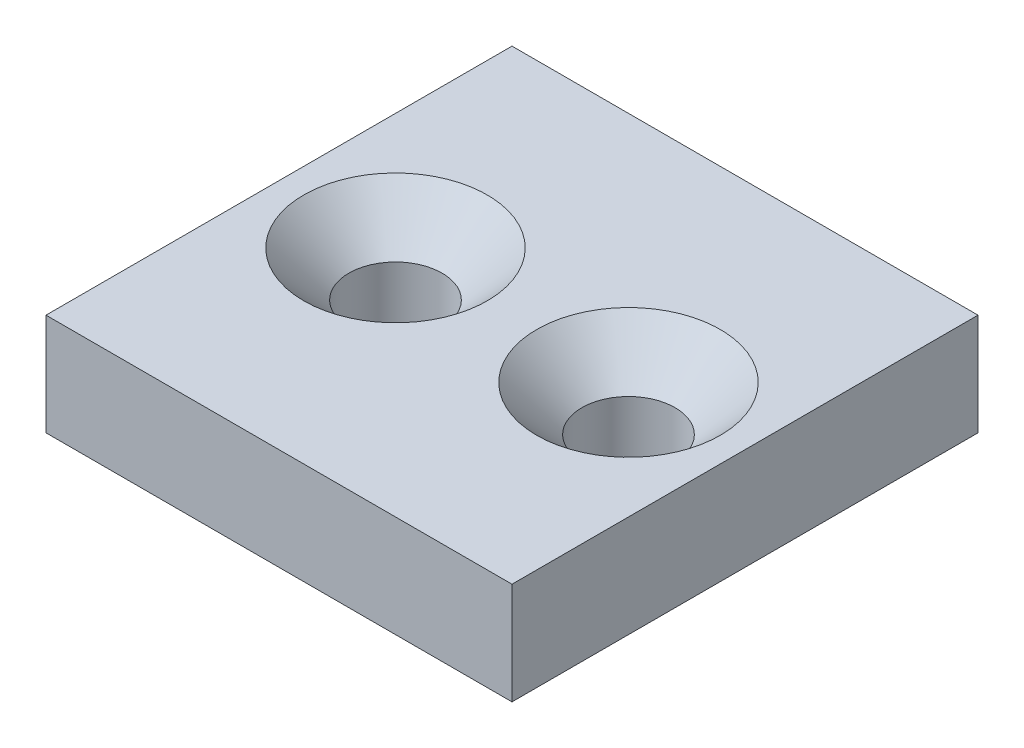
ISO-10303-21;
HEADER;
FILE_DESCRIPTION(('STEP AP214'),'2;1');
FILE_NAME('part.step','',(''),(''),'','','');
FILE_SCHEMA(('AUTOMOTIVE_DESIGN { 1 0 10303 214 1 1 1 1 }'));
ENDSEC;
DATA;
#1=APPLICATION_CONTEXT('core data for automotive mechanical design processes');
#2=APPLICATION_PROTOCOL_DEFINITION('international standard','automotive_design',2000,#1);
#3=PRODUCT_CONTEXT('',#1,'mechanical');
#4=PRODUCT('Part','Part','',(#3));
#5=PRODUCT_RELATED_PRODUCT_CATEGORY('part','',(#4));
#6=PRODUCT_DEFINITION_FORMATION('','',#4);
#7=PRODUCT_DEFINITION_CONTEXT('part definition',#1,'design');
#8=PRODUCT_DEFINITION('design','',#6,#7);
#9=PRODUCT_DEFINITION_SHAPE('','',#8);
#10=(LENGTH_UNIT() NAMED_UNIT(*) SI_UNIT(.MILLI.,.METRE.));
#11=(NAMED_UNIT(*) PLANE_ANGLE_UNIT() SI_UNIT($,.RADIAN.));
#12=(NAMED_UNIT(*) SI_UNIT($,.STERADIAN.) SOLID_ANGLE_UNIT());
#13=UNCERTAINTY_MEASURE_WITH_UNIT(LENGTH_MEASURE(1.E-05),#10,'distance_accuracy_value','');
#14=(GEOMETRIC_REPRESENTATION_CONTEXT(3) GLOBAL_UNCERTAINTY_ASSIGNED_CONTEXT((#13)) GLOBAL_UNIT_ASSIGNED_CONTEXT((#10,
#11,#12)) REPRESENTATION_CONTEXT('',''));
#15=CARTESIAN_POINT('',(0.,0.,0.));
#16=DIRECTION('',(0.,0.,1.));
#17=DIRECTION('',(1.,0.,0.));
#18=AXIS2_PLACEMENT_3D('',#15,#16,#17);
#19=CARTESIAN_POINT('',(16.,7.,-16.));
#20=DIRECTION('',(-1.,0.,0.));
#21=DIRECTION('',(0.,0.,1.));
#22=AXIS2_PLACEMENT_3D('',#19,#20,#21);
#23=PLANE('',#22);
#24=DIRECTION('',(0.,0.,-1.));
#25=VECTOR('',#24,1.);
#26=CARTESIAN_POINT('',(16.,0.,-16.));
#27=LINE('',#26,#25);
#28=CARTESIAN_POINT('',(16.,0.,16.));
#29=VERTEX_POINT('',#28);
#30=CARTESIAN_POINT('',(16.,0.,-16.));
#31=VERTEX_POINT('',#30);
#32=EDGE_CURVE('E96',#29,#31,#27,.T.);
#33=ORIENTED_EDGE('',*,*,#32,.T.);
#34=DIRECTION('',(0.,-1.,0.));
#35=VECTOR('',#34,1.);
#36=CARTESIAN_POINT('',(16.,7.,-16.));
#37=LINE('',#36,#35);
#38=CARTESIAN_POINT('',(16.,7.,-16.));
#39=VERTEX_POINT('',#38);
#40=EDGE_CURVE('E11',#39,#31,#37,.T.);
#41=ORIENTED_EDGE('',*,*,#40,.F.);
#42=DIRECTION('',(0.,0.,-1.));
#43=VECTOR('',#42,1.);
#44=CARTESIAN_POINT('',(16.,7.,-16.));
#45=LINE('',#44,#43);
#46=CARTESIAN_POINT('',(16.,7.,16.));
#47=VERTEX_POINT('',#46);
#48=EDGE_CURVE('E84',#47,#39,#45,.T.);
#49=ORIENTED_EDGE('',*,*,#48,.F.);
#50=DIRECTION('',(0.,-1.,0.));
#51=VECTOR('',#50,1.);
#52=CARTESIAN_POINT('',(16.,7.,16.));
#53=LINE('',#52,#51);
#54=EDGE_CURVE('E92',#47,#29,#53,.T.);
#55=ORIENTED_EDGE('',*,*,#54,.T.);
#56=EDGE_LOOP('',(#33,#41,#49,#55));
#57=FACE_BOUND('',#56,.T.);
#58=ADVANCED_FACE('F33',(#57),#23,.F.);
#59=CARTESIAN_POINT('',(-16.,7.,-16.));
#60=DIRECTION('',(0.,0.,1.));
#61=DIRECTION('',(1.,0.,0.));
#62=AXIS2_PLACEMENT_3D('',#59,#60,#61);
#63=PLANE('',#62);
#64=DIRECTION('',(-1.,0.,0.));
#65=VECTOR('',#64,1.);
#66=CARTESIAN_POINT('',(-16.,0.,-16.));
#67=LINE('',#66,#65);
#68=CARTESIAN_POINT('',(-16.,0.,-16.));
#69=VERTEX_POINT('',#68);
#70=EDGE_CURVE('E88',#31,#69,#67,.T.);
#71=ORIENTED_EDGE('',*,*,#70,.T.);
#72=DIRECTION('',(0.,-1.,0.));
#73=VECTOR('',#72,1.);
#74=CARTESIAN_POINT('',(-16.,7.,-16.));
#75=LINE('',#74,#73);
#76=CARTESIAN_POINT('',(-16.,7.,-16.));
#77=VERTEX_POINT('',#76);
#78=EDGE_CURVE('E41',#77,#69,#75,.T.);
#79=ORIENTED_EDGE('',*,*,#78,.F.);
#80=DIRECTION('',(-1.,0.,0.));
#81=VECTOR('',#80,1.);
#82=CARTESIAN_POINT('',(-16.,7.,-16.));
#83=LINE('',#82,#81);
#84=EDGE_CURVE('E79',#39,#77,#83,.T.);
#85=ORIENTED_EDGE('',*,*,#84,.F.);
#86=ORIENTED_EDGE('',*,*,#40,.T.);
#87=EDGE_LOOP('',(#71,#79,#85,#86));
#88=FACE_BOUND('',#87,.T.);
#89=ADVANCED_FACE('F87',(#88),#63,.F.);
#90=CARTESIAN_POINT('',(-16.,7.,-16.));
#91=DIRECTION('',(1.,0.,0.));
#92=DIRECTION('',(0.,0.,-1.));
#93=AXIS2_PLACEMENT_3D('',#90,#91,#92);
#94=PLANE('',#93);
#95=DIRECTION('',(0.,0.,1.));
#96=VECTOR('',#95,1.);
#97=CARTESIAN_POINT('',(-16.,0.,-16.));
#98=LINE('',#97,#96);
#99=CARTESIAN_POINT('',(-16.,0.,16.));
#100=VERTEX_POINT('',#99);
#101=EDGE_CURVE('E66',#69,#100,#98,.T.);
#102=ORIENTED_EDGE('',*,*,#101,.T.);
#103=DIRECTION('',(0.,-1.,0.));
#104=VECTOR('',#103,1.);
#105=CARTESIAN_POINT('',(-16.,7.,16.));
#106=LINE('',#105,#104);
#107=CARTESIAN_POINT('',(-16.,7.,16.));
#108=VERTEX_POINT('',#107);
#109=EDGE_CURVE('E89',#108,#100,#106,.T.);
#110=ORIENTED_EDGE('',*,*,#109,.F.);
#111=DIRECTION('',(0.,0.,1.));
#112=VECTOR('',#111,1.);
#113=CARTESIAN_POINT('',(-16.,7.,-16.));
#114=LINE('',#113,#112);
#115=EDGE_CURVE('E82',#77,#108,#114,.T.);
#116=ORIENTED_EDGE('',*,*,#115,.F.);
#117=ORIENTED_EDGE('',*,*,#78,.T.);
#118=EDGE_LOOP('',(#102,#110,#116,#117));
#119=FACE_BOUND('',#118,.T.);
#120=ADVANCED_FACE('F90',(#119),#94,.F.);
#121=CARTESIAN_POINT('',(-16.,7.,16.));
#122=DIRECTION('',(0.,0.,-1.));
#123=DIRECTION('',(-1.,0.,0.));
#124=AXIS2_PLACEMENT_3D('',#121,#122,#123);
#125=PLANE('',#124);
#126=DIRECTION('',(1.,0.,0.));
#127=VECTOR('',#126,1.);
#128=CARTESIAN_POINT('',(-16.,0.,16.));
#129=LINE('',#128,#127);
#130=EDGE_CURVE('E72',#100,#29,#129,.T.);
#131=ORIENTED_EDGE('',*,*,#130,.T.);
#132=ORIENTED_EDGE('',*,*,#54,.F.);
#133=DIRECTION('',(1.,0.,0.));
#134=VECTOR('',#133,1.);
#135=CARTESIAN_POINT('',(-16.,7.,16.));
#136=LINE('',#135,#134);
#137=EDGE_CURVE('E49',#108,#47,#136,.T.);
#138=ORIENTED_EDGE('',*,*,#137,.F.);
#139=ORIENTED_EDGE('',*,*,#109,.T.);
#140=EDGE_LOOP('',(#131,#132,#138,#139));
#141=FACE_BOUND('',#140,.T.);
#142=ADVANCED_FACE('F104',(#141),#125,.F.);
#143=CARTESIAN_POINT('',(0.,7.,0.));
#144=DIRECTION('',(0.,1.,0.));
#145=DIRECTION('',(0.,0.,1.));
#146=AXIS2_PLACEMENT_3D('',#143,#144,#145);
#147=PLANE('',#146);
#148=CARTESIAN_POINT('',(8.,7.,0.));
#149=DIRECTION('',(0.,1.,0.));
#150=DIRECTION('',(0.,0.,1.));
#151=AXIS2_PLACEMENT_3D('',#148,#149,#150);
#152=CIRCLE('',#151,6.3);
#153=CARTESIAN_POINT('',(8.,7.,6.3));
#154=VERTEX_POINT('',#153);
#155=EDGE_CURVE('E124',#154,#154,#152,.T.);
#156=ORIENTED_EDGE('',*,*,#155,.F.);
#157=EDGE_LOOP('',(#156));
#158=FACE_BOUND('',#157,.T.);
#159=CARTESIAN_POINT('',(-8.,7.,0.));
#160=DIRECTION('',(0.,1.,0.));
#161=DIRECTION('',(0.,0.,1.));
#162=AXIS2_PLACEMENT_3D('',#159,#160,#161);
#163=CIRCLE('',#162,6.3);
#164=CARTESIAN_POINT('',(-8.,7.,6.3));
#165=VERTEX_POINT('',#164);
#166=EDGE_CURVE('E115',#165,#165,#163,.T.);
#167=ORIENTED_EDGE('',*,*,#166,.F.);
#168=EDGE_LOOP('',(#167));
#169=FACE_BOUND('',#168,.T.);
#170=ORIENTED_EDGE('',*,*,#48,.T.);
#171=ORIENTED_EDGE('',*,*,#84,.T.);
#172=ORIENTED_EDGE('',*,*,#115,.T.);
#173=ORIENTED_EDGE('',*,*,#137,.T.);
#174=EDGE_LOOP('',(#170,#171,#172,#173));
#175=FACE_BOUND('',#174,.T.);
#176=ADVANCED_FACE('F80',(#158,#169,#175),#147,.T.);
#177=CARTESIAN_POINT('',(0.,0.,0.));
#178=DIRECTION('',(0.,1.,0.));
#179=DIRECTION('',(0.,0.,1.));
#180=AXIS2_PLACEMENT_3D('',#177,#178,#179);
#181=PLANE('',#180);
#182=CARTESIAN_POINT('',(8.,0.,0.));
#183=DIRECTION('',(0.,1.,0.));
#184=DIRECTION('',(0.,0.,1.));
#185=AXIS2_PLACEMENT_3D('',#182,#183,#184);
#186=CIRCLE('',#185,3.2);
#187=CARTESIAN_POINT('',(8.,0.,3.2));
#188=VERTEX_POINT('',#187);
#189=EDGE_CURVE('E118',#188,#188,#186,.T.);
#190=ORIENTED_EDGE('',*,*,#189,.T.);
#191=EDGE_LOOP('',(#190));
#192=FACE_BOUND('',#191,.T.);
#193=CARTESIAN_POINT('',(-8.,0.,0.));
#194=DIRECTION('',(0.,1.,0.));
#195=DIRECTION('',(0.,0.,1.));
#196=AXIS2_PLACEMENT_3D('',#193,#194,#195);
#197=CIRCLE('',#196,3.2);
#198=CARTESIAN_POINT('',(-8.,0.,3.2));
#199=VERTEX_POINT('',#198);
#200=EDGE_CURVE('E99',#199,#199,#197,.T.);
#201=ORIENTED_EDGE('',*,*,#200,.T.);
#202=EDGE_LOOP('',(#201));
#203=FACE_BOUND('',#202,.T.);
#204=ORIENTED_EDGE('',*,*,#32,.F.);
#205=ORIENTED_EDGE('',*,*,#130,.F.);
#206=ORIENTED_EDGE('',*,*,#101,.F.);
#207=ORIENTED_EDGE('',*,*,#70,.F.);
#208=EDGE_LOOP('',(#204,#205,#206,#207));
#209=FACE_BOUND('',#208,.T.);
#210=ADVANCED_FACE('F107',(#192,#203,#209),#181,.F.);
#211=CARTESIAN_POINT('',(-8.,7.,0.));
#212=DIRECTION('',(0.,1.,0.));
#213=DIRECTION('',(0.,0.,1.));
#214=AXIS2_PLACEMENT_3D('',#211,#212,#213);
#215=CYLINDRICAL_SURFACE('',#214,3.2);
#216=ORIENTED_EDGE('',*,*,#200,.F.);
#217=EDGE_LOOP('',(#216));
#218=FACE_BOUND('',#217,.T.);
#219=CARTESIAN_POINT('',(-8.,3.90000000000002,0.));
#220=DIRECTION('',(0.,1.,0.));
#221=DIRECTION('',(0.,0.,1.));
#222=AXIS2_PLACEMENT_3D('',#219,#220,#221);
#223=CIRCLE('',#222,3.2);
#224=CARTESIAN_POINT('',(-8.,3.90000000000002,3.2));
#225=VERTEX_POINT('',#224);
#226=EDGE_CURVE('E112',#225,#225,#223,.T.);
#227=ORIENTED_EDGE('',*,*,#226,.T.);
#228=EDGE_LOOP('',(#227));
#229=FACE_BOUND('',#228,.T.);
#230=ADVANCED_FACE('F138',(#218,#229),#215,.F.);
#231=CARTESIAN_POINT('',(-8.,7.,0.));
#232=DIRECTION('',(0.,1.,0.));
#233=DIRECTION('',(0.,0.,1.));
#234=AXIS2_PLACEMENT_3D('',#231,#232,#233);
#235=CONICAL_SURFACE('',#234,6.3,0.78539816339745);
#236=ORIENTED_EDGE('',*,*,#226,.F.);
#237=EDGE_LOOP('',(#236));
#238=FACE_BOUND('',#237,.T.);
#239=ORIENTED_EDGE('',*,*,#166,.T.);
#240=EDGE_LOOP('',(#239));
#241=FACE_BOUND('',#240,.T.);
#242=ADVANCED_FACE('F135',(#238,#241),#235,.F.);
#243=CARTESIAN_POINT('',(8.,7.,0.));
#244=DIRECTION('',(0.,1.,0.));
#245=DIRECTION('',(0.,0.,1.));
#246=AXIS2_PLACEMENT_3D('',#243,#244,#245);
#247=CYLINDRICAL_SURFACE('',#246,3.2);
#248=ORIENTED_EDGE('',*,*,#189,.F.);
#249=EDGE_LOOP('',(#248));
#250=FACE_BOUND('',#249,.T.);
#251=CARTESIAN_POINT('',(8.,3.90000000000002,0.));
#252=DIRECTION('',(0.,1.,0.));
#253=DIRECTION('',(0.,0.,1.));
#254=AXIS2_PLACEMENT_3D('',#251,#252,#253);
#255=CIRCLE('',#254,3.2);
#256=CARTESIAN_POINT('',(8.,3.90000000000002,3.2));
#257=VERTEX_POINT('',#256);
#258=EDGE_CURVE('E121',#257,#257,#255,.T.);
#259=ORIENTED_EDGE('',*,*,#258,.T.);
#260=EDGE_LOOP('',(#259));
#261=FACE_BOUND('',#260,.T.);
#262=ADVANCED_FACE('F137',(#250,#261),#247,.F.);
#263=CARTESIAN_POINT('',(8.,7.,0.));
#264=DIRECTION('',(0.,1.,0.));
#265=DIRECTION('',(0.,0.,1.));
#266=AXIS2_PLACEMENT_3D('',#263,#264,#265);
#267=CONICAL_SURFACE('',#266,6.3,0.78539816339745);
#268=ORIENTED_EDGE('',*,*,#258,.F.);
#269=EDGE_LOOP('',(#268));
#270=FACE_BOUND('',#269,.T.);
#271=ORIENTED_EDGE('',*,*,#155,.T.);
#272=EDGE_LOOP('',(#271));
#273=FACE_BOUND('',#272,.T.);
#274=ADVANCED_FACE('F128',(#270,#273),#267,.F.);
#275=CLOSED_SHELL('',(#58,#89,#120,#142,#176,#210,#230,#242,#262,#274));
#276=MANIFOLD_SOLID_BREP('B2',#275);
#277=ADVANCED_BREP_SHAPE_REPRESENTATION('',(#18,#276),#14);
#278=SHAPE_DEFINITION_REPRESENTATION(#9,#277);
ENDSEC;
END-ISO-10303-21;
